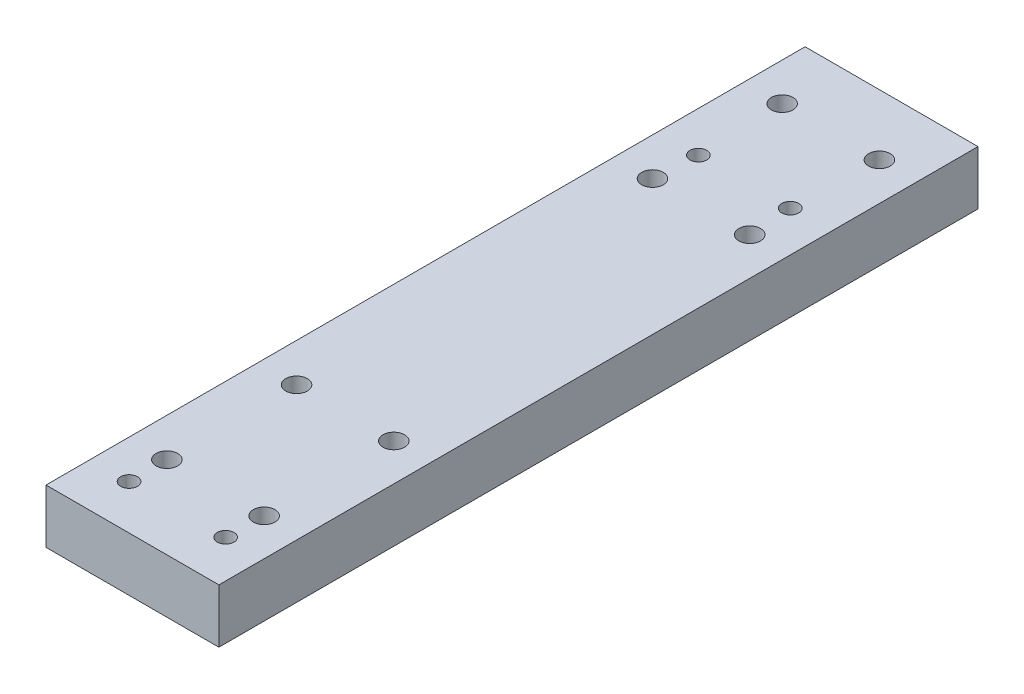
ISO-10303-21;
HEADER;
FILE_DESCRIPTION(('STEP AP214'),'2;1');
FILE_NAME('part.step','',(''),(''),'','','');
FILE_SCHEMA(('AUTOMOTIVE_DESIGN { 1 0 10303 214 1 1 1 1 }'));
ENDSEC;
DATA;
#1=APPLICATION_CONTEXT('core data for automotive mechanical design processes');
#2=APPLICATION_PROTOCOL_DEFINITION('international standard','automotive_design',2000,#1);
#3=PRODUCT_CONTEXT('',#1,'mechanical');
#4=PRODUCT('Part','Part','',(#3));
#5=PRODUCT_RELATED_PRODUCT_CATEGORY('part','',(#4));
#6=PRODUCT_DEFINITION_FORMATION('','',#4);
#7=PRODUCT_DEFINITION_CONTEXT('part definition',#1,'design');
#8=PRODUCT_DEFINITION('design','',#6,#7);
#9=PRODUCT_DEFINITION_SHAPE('','',#8);
#10=(LENGTH_UNIT() NAMED_UNIT(*) SI_UNIT(.MILLI.,.METRE.));
#11=(NAMED_UNIT(*) PLANE_ANGLE_UNIT() SI_UNIT($,.RADIAN.));
#12=(NAMED_UNIT(*) SI_UNIT($,.STERADIAN.) SOLID_ANGLE_UNIT());
#13=UNCERTAINTY_MEASURE_WITH_UNIT(LENGTH_MEASURE(1.E-05),#10,'distance_accuracy_value','');
#14=(GEOMETRIC_REPRESENTATION_CONTEXT(3) GLOBAL_UNCERTAINTY_ASSIGNED_CONTEXT((#13)) GLOBAL_UNIT_ASSIGNED_CONTEXT((#10,
#11,#12)) REPRESENTATION_CONTEXT('',''));
#15=CARTESIAN_POINT('',(0.,0.,0.));
#16=DIRECTION('',(0.,0.,1.));
#17=DIRECTION('',(1.,0.,0.));
#18=AXIS2_PLACEMENT_3D('',#15,#16,#17);
#19=CARTESIAN_POINT('',(0.,10.,0.));
#20=DIRECTION('',(0.,1.,0.));
#21=DIRECTION('',(0.,0.,1.));
#22=AXIS2_PLACEMENT_3D('',#19,#20,#21);
#23=PLANE('',#22);
#24=CARTESIAN_POINT('',(9.12227938256409,10.,54.999894702405));
#25=DIRECTION('',(0.,1.,0.));
#26=DIRECTION('',(0.,0.,1.));
#27=AXIS2_PLACEMENT_3D('',#24,#25,#26);
#28=CIRCLE('',#27,2.);
#29=CARTESIAN_POINT('',(9.12227938256409,10.,56.999894702405));
#30=VERTEX_POINT('',#29);
#31=EDGE_CURVE('E169',#30,#30,#28,.T.);
#32=ORIENTED_EDGE('',*,*,#31,.F.);
#33=EDGE_LOOP('',(#32));
#34=FACE_BOUND('',#33,.T.);
#35=CARTESIAN_POINT('',(-8.87772061743592,10.,30.999894702405));
#36=DIRECTION('',(0.,1.,0.));
#37=DIRECTION('',(0.,0.,1.));
#38=AXIS2_PLACEMENT_3D('',#35,#36,#37);
#39=CIRCLE('',#38,2.);
#40=CARTESIAN_POINT('',(-8.87772061743592,10.,32.999894702405));
#41=VERTEX_POINT('',#40);
#42=EDGE_CURVE('E157',#41,#41,#39,.T.);
#43=ORIENTED_EDGE('',*,*,#42,.F.);
#44=EDGE_LOOP('',(#43));
#45=FACE_BOUND('',#44,.T.);
#46=CARTESIAN_POINT('',(-8.87772061743592,10.,61.999894702405));
#47=DIRECTION('',(0.,1.,0.));
#48=DIRECTION('',(0.,0.,1.));
#49=AXIS2_PLACEMENT_3D('',#46,#47,#48);
#50=CIRCLE('',#49,1.55);
#51=CARTESIAN_POINT('',(-8.87772061743592,10.,63.549894702405));
#52=VERTEX_POINT('',#51);
#53=EDGE_CURVE('E145',#52,#52,#50,.T.);
#54=ORIENTED_EDGE('',*,*,#53,.F.);
#55=EDGE_LOOP('',(#54));
#56=FACE_BOUND('',#55,.T.);
#57=CARTESIAN_POINT('',(-8.50000000000001,10.,-43.000105297595));
#58=DIRECTION('',(0.,1.,0.));
#59=DIRECTION('',(0.,0.,1.));
#60=AXIS2_PLACEMENT_3D('',#57,#58,#59);
#61=CIRCLE('',#60,1.55);
#62=CARTESIAN_POINT('',(-8.50000000000001,10.,-41.450105297595));
#63=VERTEX_POINT('',#62);
#64=EDGE_CURVE('E133',#63,#63,#61,.T.);
#65=ORIENTED_EDGE('',*,*,#64,.F.);
#66=EDGE_LOOP('',(#65));
#67=FACE_BOUND('',#66,.T.);
#68=CARTESIAN_POINT('',(-9.00000000000001,10.,-35.));
#69=DIRECTION('',(0.,1.,0.));
#70=DIRECTION('',(0.,0.,1.));
#71=AXIS2_PLACEMENT_3D('',#68,#69,#70);
#72=CIRCLE('',#71,2.);
#73=CARTESIAN_POINT('',(-9.00000000000001,10.,-33.));
#74=VERTEX_POINT('',#73);
#75=EDGE_CURVE('E121',#74,#74,#72,.T.);
#76=ORIENTED_EDGE('',*,*,#75,.F.);
#77=EDGE_LOOP('',(#76));
#78=FACE_BOUND('',#77,.T.);
#79=CARTESIAN_POINT('',(-9.00000000000001,10.,-59.));
#80=DIRECTION('',(0.,1.,0.));
#81=DIRECTION('',(0.,0.,1.));
#82=AXIS2_PLACEMENT_3D('',#79,#80,#81);
#83=CIRCLE('',#82,2.);
#84=CARTESIAN_POINT('',(-9.00000000000001,10.,-57.));
#85=VERTEX_POINT('',#84);
#86=EDGE_CURVE('E100',#85,#85,#83,.T.);
#87=ORIENTED_EDGE('',*,*,#86,.F.);
#88=EDGE_LOOP('',(#87));
#89=FACE_BOUND('',#88,.T.);
#90=DIRECTION('',(0.,0.,-1.));
#91=VECTOR('',#90,1.);
#92=CARTESIAN_POINT('',(16.,10.,-70.25));
#93=LINE('',#92,#91);
#94=CARTESIAN_POINT('',(16.,10.,70.25));
#95=VERTEX_POINT('',#94);
#96=CARTESIAN_POINT('',(16.,10.,-70.25));
#97=VERTEX_POINT('',#96);
#98=EDGE_CURVE('E85',#95,#97,#93,.T.);
#99=ORIENTED_EDGE('',*,*,#98,.T.);
#100=DIRECTION('',(-1.,0.,0.));
#101=VECTOR('',#100,1.);
#102=CARTESIAN_POINT('',(-16.,10.,-70.25));
#103=LINE('',#102,#101);
#104=CARTESIAN_POINT('',(-16.,10.,-70.25));
#105=VERTEX_POINT('',#104);
#106=EDGE_CURVE('E80',#97,#105,#103,.T.);
#107=ORIENTED_EDGE('',*,*,#106,.T.);
#108=DIRECTION('',(0.,0.,1.));
#109=VECTOR('',#108,1.);
#110=CARTESIAN_POINT('',(-16.,10.,-70.25));
#111=LINE('',#110,#109);
#112=CARTESIAN_POINT('',(-16.,10.,70.25));
#113=VERTEX_POINT('',#112);
#114=EDGE_CURVE('E83',#105,#113,#111,.T.);
#115=ORIENTED_EDGE('',*,*,#114,.T.);
#116=DIRECTION('',(1.,0.,0.));
#117=VECTOR('',#116,1.);
#118=CARTESIAN_POINT('',(-16.,10.,70.25));
#119=LINE('',#118,#117);
#120=EDGE_CURVE('E50',#113,#95,#119,.T.);
#121=ORIENTED_EDGE('',*,*,#120,.T.);
#122=EDGE_LOOP('',(#99,#107,#115,#121));
#123=FACE_BOUND('',#122,.T.);
#124=CARTESIAN_POINT('',(8.99999999999999,10.,-59.));
#125=DIRECTION('',(0.,1.,0.));
#126=DIRECTION('',(0.,0.,1.));
#127=AXIS2_PLACEMENT_3D('',#124,#125,#126);
#128=CIRCLE('',#127,2.);
#129=CARTESIAN_POINT('',(8.99999999999999,10.,-57.));
#130=VERTEX_POINT('',#129);
#131=EDGE_CURVE('E115',#130,#130,#128,.T.);
#132=ORIENTED_EDGE('',*,*,#131,.F.);
#133=EDGE_LOOP('',(#132));
#134=FACE_BOUND('',#133,.T.);
#135=CARTESIAN_POINT('',(8.99999999999999,10.,-35.));
#136=DIRECTION('',(0.,1.,0.));
#137=DIRECTION('',(0.,0.,1.));
#138=AXIS2_PLACEMENT_3D('',#135,#136,#137);
#139=CIRCLE('',#138,2.);
#140=CARTESIAN_POINT('',(8.99999999999999,10.,-33.));
#141=VERTEX_POINT('',#140);
#142=EDGE_CURVE('E127',#141,#141,#139,.T.);
#143=ORIENTED_EDGE('',*,*,#142,.F.);
#144=EDGE_LOOP('',(#143));
#145=FACE_BOUND('',#144,.T.);
#146=CARTESIAN_POINT('',(8.49999999999999,10.,-43.000105297595));
#147=DIRECTION('',(0.,1.,0.));
#148=DIRECTION('',(0.,0.,1.));
#149=AXIS2_PLACEMENT_3D('',#146,#147,#148);
#150=CIRCLE('',#149,1.55);
#151=CARTESIAN_POINT('',(8.49999999999999,10.,-41.450105297595));
#152=VERTEX_POINT('',#151);
#153=EDGE_CURVE('E139',#152,#152,#150,.T.);
#154=ORIENTED_EDGE('',*,*,#153,.F.);
#155=EDGE_LOOP('',(#154));
#156=FACE_BOUND('',#155,.T.);
#157=CARTESIAN_POINT('',(8.99999999999999,10.,61.999894702405));
#158=DIRECTION('',(0.,1.,0.));
#159=DIRECTION('',(0.,0.,1.));
#160=AXIS2_PLACEMENT_3D('',#157,#158,#159);
#161=CIRCLE('',#160,1.55);
#162=CARTESIAN_POINT('',(8.99999999999999,10.,63.549894702405));
#163=VERTEX_POINT('',#162);
#164=EDGE_CURVE('E151',#163,#163,#161,.T.);
#165=ORIENTED_EDGE('',*,*,#164,.F.);
#166=EDGE_LOOP('',(#165));
#167=FACE_BOUND('',#166,.T.);
#168=CARTESIAN_POINT('',(9.12227938256408,10.,30.999894702405));
#169=DIRECTION('',(0.,1.,0.));
#170=DIRECTION('',(0.,0.,1.));
#171=AXIS2_PLACEMENT_3D('',#168,#169,#170);
#172=CIRCLE('',#171,2.);
#173=CARTESIAN_POINT('',(9.12227938256408,10.,32.999894702405));
#174=VERTEX_POINT('',#173);
#175=EDGE_CURVE('E163',#174,#174,#172,.T.);
#176=ORIENTED_EDGE('',*,*,#175,.F.);
#177=EDGE_LOOP('',(#176));
#178=FACE_BOUND('',#177,.T.);
#179=CARTESIAN_POINT('',(-8.87772061743591,10.,54.999894702405));
#180=DIRECTION('',(0.,1.,0.));
#181=DIRECTION('',(0.,0.,1.));
#182=AXIS2_PLACEMENT_3D('',#179,#180,#181);
#183=CIRCLE('',#182,2.);
#184=CARTESIAN_POINT('',(-8.87772061743591,10.,56.999894702405));
#185=VERTEX_POINT('',#184);
#186=EDGE_CURVE('E175',#185,#185,#183,.T.);
#187=ORIENTED_EDGE('',*,*,#186,.F.);
#188=EDGE_LOOP('',(#187));
#189=FACE_BOUND('',#188,.T.);
#190=ADVANCED_FACE('F33',(#34,#45,#56,#67,#78,#89,#123,#134,#145,#156,#167,#178,#189),#23,.T.);
#191=CARTESIAN_POINT('',(0.,0.,0.));
#192=DIRECTION('',(0.,1.,0.));
#193=DIRECTION('',(0.,0.,1.));
#194=AXIS2_PLACEMENT_3D('',#191,#192,#193);
#195=PLANE('',#194);
#196=DIRECTION('',(0.,0.,-1.));
#197=VECTOR('',#196,1.);
#198=CARTESIAN_POINT('',(16.,0.,-70.25));
#199=LINE('',#198,#197);
#200=CARTESIAN_POINT('',(16.,0.,70.25));
#201=VERTEX_POINT('',#200);
#202=CARTESIAN_POINT('',(16.,0.,-70.25));
#203=VERTEX_POINT('',#202);
#204=EDGE_CURVE('E97',#201,#203,#199,.T.);
#205=ORIENTED_EDGE('',*,*,#204,.F.);
#206=DIRECTION('',(1.,0.,0.));
#207=VECTOR('',#206,1.);
#208=CARTESIAN_POINT('',(-16.,0.,70.25));
#209=LINE('',#208,#207);
#210=CARTESIAN_POINT('',(-16.,0.,70.25));
#211=VERTEX_POINT('',#210);
#212=EDGE_CURVE('E73',#211,#201,#209,.T.);
#213=ORIENTED_EDGE('',*,*,#212,.F.);
#214=DIRECTION('',(0.,0.,1.));
#215=VECTOR('',#214,1.);
#216=CARTESIAN_POINT('',(-16.,0.,-70.25));
#217=LINE('',#216,#215);
#218=CARTESIAN_POINT('',(-16.,0.,-70.25));
#219=VERTEX_POINT('',#218);
#220=EDGE_CURVE('E67',#219,#211,#217,.T.);
#221=ORIENTED_EDGE('',*,*,#220,.F.);
#222=DIRECTION('',(-1.,0.,0.));
#223=VECTOR('',#222,1.);
#224=CARTESIAN_POINT('',(-16.,0.,-70.25));
#225=LINE('',#224,#223);
#226=EDGE_CURVE('E89',#203,#219,#225,.T.);
#227=ORIENTED_EDGE('',*,*,#226,.F.);
#228=EDGE_LOOP('',(#205,#213,#221,#227));
#229=FACE_BOUND('',#228,.T.);
#230=CARTESIAN_POINT('',(-9.00000000000001,0.,-59.));
#231=DIRECTION('',(0.,1.,0.));
#232=DIRECTION('',(0.,0.,1.));
#233=AXIS2_PLACEMENT_3D('',#230,#231,#232);
#234=CIRCLE('',#233,2.);
#235=CARTESIAN_POINT('',(-9.00000000000001,0.,-57.));
#236=VERTEX_POINT('',#235);
#237=EDGE_CURVE('E112',#236,#236,#234,.T.);
#238=ORIENTED_EDGE('',*,*,#237,.T.);
#239=EDGE_LOOP('',(#238));
#240=FACE_BOUND('',#239,.T.);
#241=CARTESIAN_POINT('',(8.99999999999999,0.,-59.));
#242=DIRECTION('',(0.,1.,0.));
#243=DIRECTION('',(0.,0.,1.));
#244=AXIS2_PLACEMENT_3D('',#241,#242,#243);
#245=CIRCLE('',#244,2.);
#246=CARTESIAN_POINT('',(8.99999999999999,0.,-57.));
#247=VERTEX_POINT('',#246);
#248=EDGE_CURVE('E118',#247,#247,#245,.T.);
#249=ORIENTED_EDGE('',*,*,#248,.T.);
#250=EDGE_LOOP('',(#249));
#251=FACE_BOUND('',#250,.T.);
#252=CARTESIAN_POINT('',(-9.00000000000001,0.,-35.));
#253=DIRECTION('',(0.,1.,0.));
#254=DIRECTION('',(0.,0.,1.));
#255=AXIS2_PLACEMENT_3D('',#252,#253,#254);
#256=CIRCLE('',#255,2.);
#257=CARTESIAN_POINT('',(-9.00000000000001,0.,-33.));
#258=VERTEX_POINT('',#257);
#259=EDGE_CURVE('E124',#258,#258,#256,.T.);
#260=ORIENTED_EDGE('',*,*,#259,.T.);
#261=EDGE_LOOP('',(#260));
#262=FACE_BOUND('',#261,.T.);
#263=CARTESIAN_POINT('',(8.99999999999999,0.,-35.));
#264=DIRECTION('',(0.,1.,0.));
#265=DIRECTION('',(0.,0.,1.));
#266=AXIS2_PLACEMENT_3D('',#263,#264,#265);
#267=CIRCLE('',#266,2.);
#268=CARTESIAN_POINT('',(8.99999999999999,0.,-33.));
#269=VERTEX_POINT('',#268);
#270=EDGE_CURVE('E130',#269,#269,#267,.T.);
#271=ORIENTED_EDGE('',*,*,#270,.T.);
#272=EDGE_LOOP('',(#271));
#273=FACE_BOUND('',#272,.T.);
#274=CARTESIAN_POINT('',(-8.50000000000001,0.,-43.000105297595));
#275=DIRECTION('',(0.,1.,0.));
#276=DIRECTION('',(0.,0.,1.));
#277=AXIS2_PLACEMENT_3D('',#274,#275,#276);
#278=CIRCLE('',#277,1.55);
#279=CARTESIAN_POINT('',(-8.50000000000001,0.,-41.450105297595));
#280=VERTEX_POINT('',#279);
#281=EDGE_CURVE('E136',#280,#280,#278,.T.);
#282=ORIENTED_EDGE('',*,*,#281,.T.);
#283=EDGE_LOOP('',(#282));
#284=FACE_BOUND('',#283,.T.);
#285=CARTESIAN_POINT('',(8.49999999999999,0.,-43.000105297595));
#286=DIRECTION('',(0.,1.,0.));
#287=DIRECTION('',(0.,0.,1.));
#288=AXIS2_PLACEMENT_3D('',#285,#286,#287);
#289=CIRCLE('',#288,1.55);
#290=CARTESIAN_POINT('',(8.49999999999999,0.,-41.450105297595));
#291=VERTEX_POINT('',#290);
#292=EDGE_CURVE('E142',#291,#291,#289,.T.);
#293=ORIENTED_EDGE('',*,*,#292,.T.);
#294=EDGE_LOOP('',(#293));
#295=FACE_BOUND('',#294,.T.);
#296=CARTESIAN_POINT('',(-8.87772061743592,0.,61.999894702405));
#297=DIRECTION('',(0.,1.,0.));
#298=DIRECTION('',(0.,0.,1.));
#299=AXIS2_PLACEMENT_3D('',#296,#297,#298);
#300=CIRCLE('',#299,1.55);
#301=CARTESIAN_POINT('',(-8.87772061743592,0.,63.549894702405));
#302=VERTEX_POINT('',#301);
#303=EDGE_CURVE('E148',#302,#302,#300,.T.);
#304=ORIENTED_EDGE('',*,*,#303,.T.);
#305=EDGE_LOOP('',(#304));
#306=FACE_BOUND('',#305,.T.);
#307=CARTESIAN_POINT('',(8.99999999999999,0.,61.999894702405));
#308=DIRECTION('',(0.,1.,0.));
#309=DIRECTION('',(0.,0.,1.));
#310=AXIS2_PLACEMENT_3D('',#307,#308,#309);
#311=CIRCLE('',#310,1.55);
#312=CARTESIAN_POINT('',(8.99999999999999,0.,63.549894702405));
#313=VERTEX_POINT('',#312);
#314=EDGE_CURVE('E154',#313,#313,#311,.T.);
#315=ORIENTED_EDGE('',*,*,#314,.T.);
#316=EDGE_LOOP('',(#315));
#317=FACE_BOUND('',#316,.T.);
#318=CARTESIAN_POINT('',(-8.87772061743592,0.,30.999894702405));
#319=DIRECTION('',(0.,1.,0.));
#320=DIRECTION('',(0.,0.,1.));
#321=AXIS2_PLACEMENT_3D('',#318,#319,#320);
#322=CIRCLE('',#321,2.);
#323=CARTESIAN_POINT('',(-8.87772061743592,0.,32.999894702405));
#324=VERTEX_POINT('',#323);
#325=EDGE_CURVE('E160',#324,#324,#322,.T.);
#326=ORIENTED_EDGE('',*,*,#325,.T.);
#327=EDGE_LOOP('',(#326));
#328=FACE_BOUND('',#327,.T.);
#329=CARTESIAN_POINT('',(9.12227938256408,0.,30.999894702405));
#330=DIRECTION('',(0.,1.,0.));
#331=DIRECTION('',(0.,0.,1.));
#332=AXIS2_PLACEMENT_3D('',#329,#330,#331);
#333=CIRCLE('',#332,2.);
#334=CARTESIAN_POINT('',(9.12227938256408,0.,32.999894702405));
#335=VERTEX_POINT('',#334);
#336=EDGE_CURVE('E166',#335,#335,#333,.T.);
#337=ORIENTED_EDGE('',*,*,#336,.T.);
#338=EDGE_LOOP('',(#337));
#339=FACE_BOUND('',#338,.T.);
#340=CARTESIAN_POINT('',(9.12227938256409,0.,54.999894702405));
#341=DIRECTION('',(0.,1.,0.));
#342=DIRECTION('',(0.,0.,1.));
#343=AXIS2_PLACEMENT_3D('',#340,#341,#342);
#344=CIRCLE('',#343,2.);
#345=CARTESIAN_POINT('',(9.12227938256409,0.,56.999894702405));
#346=VERTEX_POINT('',#345);
#347=EDGE_CURVE('E172',#346,#346,#344,.T.);
#348=ORIENTED_EDGE('',*,*,#347,.T.);
#349=EDGE_LOOP('',(#348));
#350=FACE_BOUND('',#349,.T.);
#351=CARTESIAN_POINT('',(-8.87772061743591,0.,54.999894702405));
#352=DIRECTION('',(0.,1.,0.));
#353=DIRECTION('',(0.,0.,1.));
#354=AXIS2_PLACEMENT_3D('',#351,#352,#353);
#355=CIRCLE('',#354,2.);
#356=CARTESIAN_POINT('',(-8.87772061743591,0.,56.999894702405));
#357=VERTEX_POINT('',#356);
#358=EDGE_CURVE('E178',#357,#357,#355,.T.);
#359=ORIENTED_EDGE('',*,*,#358,.T.);
#360=EDGE_LOOP('',(#359));
#361=FACE_BOUND('',#360,.T.);
#362=ADVANCED_FACE('F108',(#229,#240,#251,#262,#273,#284,#295,#306,#317,#328,#339,#350,#361),
#195,.F.);
#363=CARTESIAN_POINT('',(16.,10.,-70.25));
#364=DIRECTION('',(-1.,0.,0.));
#365=DIRECTION('',(0.,0.,1.));
#366=AXIS2_PLACEMENT_3D('',#363,#364,#365);
#367=PLANE('',#366);
#368=ORIENTED_EDGE('',*,*,#204,.T.);
#369=DIRECTION('',(0.,-1.,0.));
#370=VECTOR('',#369,1.);
#371=CARTESIAN_POINT('',(16.,10.,-70.25));
#372=LINE('',#371,#370);
#373=EDGE_CURVE('E11',#97,#203,#372,.T.);
#374=ORIENTED_EDGE('',*,*,#373,.F.);
#375=ORIENTED_EDGE('',*,*,#98,.F.);
#376=DIRECTION('',(0.,-1.,0.));
#377=VECTOR('',#376,1.);
#378=CARTESIAN_POINT('',(16.,10.,70.25));
#379=LINE('',#378,#377);
#380=EDGE_CURVE('E93',#95,#201,#379,.T.);
#381=ORIENTED_EDGE('',*,*,#380,.T.);
#382=EDGE_LOOP('',(#368,#374,#375,#381));
#383=FACE_BOUND('',#382,.T.);
#384=ADVANCED_FACE('F35',(#383),#367,.F.);
#385=CARTESIAN_POINT('',(-16.,10.,-70.25));
#386=DIRECTION('',(0.,0.,1.));
#387=DIRECTION('',(1.,0.,0.));
#388=AXIS2_PLACEMENT_3D('',#385,#386,#387);
#389=PLANE('',#388);
#390=ORIENTED_EDGE('',*,*,#226,.T.);
#391=DIRECTION('',(0.,-1.,0.));
#392=VECTOR('',#391,1.);
#393=CARTESIAN_POINT('',(-16.,10.,-70.25));
#394=LINE('',#393,#392);
#395=EDGE_CURVE('E42',#105,#219,#394,.T.);
#396=ORIENTED_EDGE('',*,*,#395,.F.);
#397=ORIENTED_EDGE('',*,*,#106,.F.);
#398=ORIENTED_EDGE('',*,*,#373,.T.);
#399=EDGE_LOOP('',(#390,#396,#397,#398));
#400=FACE_BOUND('',#399,.T.);
#401=ADVANCED_FACE('F88',(#400),#389,.F.);
#402=CARTESIAN_POINT('',(-16.,10.,-70.25));
#403=DIRECTION('',(1.,0.,0.));
#404=DIRECTION('',(0.,0.,-1.));
#405=AXIS2_PLACEMENT_3D('',#402,#403,#404);
#406=PLANE('',#405);
#407=ORIENTED_EDGE('',*,*,#220,.T.);
#408=DIRECTION('',(0.,-1.,0.));
#409=VECTOR('',#408,1.);
#410=CARTESIAN_POINT('',(-16.,10.,70.25));
#411=LINE('',#410,#409);
#412=EDGE_CURVE('E90',#113,#211,#411,.T.);
#413=ORIENTED_EDGE('',*,*,#412,.F.);
#414=ORIENTED_EDGE('',*,*,#114,.F.);
#415=ORIENTED_EDGE('',*,*,#395,.T.);
#416=EDGE_LOOP('',(#407,#413,#414,#415));
#417=FACE_BOUND('',#416,.T.);
#418=ADVANCED_FACE('F91',(#417),#406,.F.);
#419=CARTESIAN_POINT('',(-16.,10.,70.25));
#420=DIRECTION('',(0.,0.,-1.));
#421=DIRECTION('',(-1.,0.,0.));
#422=AXIS2_PLACEMENT_3D('',#419,#420,#421);
#423=PLANE('',#422);
#424=ORIENTED_EDGE('',*,*,#212,.T.);
#425=ORIENTED_EDGE('',*,*,#380,.F.);
#426=ORIENTED_EDGE('',*,*,#120,.F.);
#427=ORIENTED_EDGE('',*,*,#412,.T.);
#428=EDGE_LOOP('',(#424,#425,#426,#427));
#429=FACE_BOUND('',#428,.T.);
#430=ADVANCED_FACE('F105',(#429),#423,.F.);
#431=CARTESIAN_POINT('',(-9.00000000000001,10.,-59.));
#432=DIRECTION('',(0.,-1.,0.));
#433=DIRECTION('',(0.,0.,-1.));
#434=AXIS2_PLACEMENT_3D('',#431,#432,#433);
#435=CYLINDRICAL_SURFACE('',#434,2.);
#436=ORIENTED_EDGE('',*,*,#86,.T.);
#437=EDGE_LOOP('',(#436));
#438=FACE_BOUND('',#437,.T.);
#439=ORIENTED_EDGE('',*,*,#237,.F.);
#440=EDGE_LOOP('',(#439));
#441=FACE_BOUND('',#440,.T.);
#442=ADVANCED_FACE('F197',(#438,#441),#435,.F.);
#443=CARTESIAN_POINT('',(8.99999999999999,10.,-59.));
#444=DIRECTION('',(0.,-1.,0.));
#445=DIRECTION('',(0.,0.,-1.));
#446=AXIS2_PLACEMENT_3D('',#443,#444,#445);
#447=CYLINDRICAL_SURFACE('',#446,2.);
#448=ORIENTED_EDGE('',*,*,#131,.T.);
#449=EDGE_LOOP('',(#448));
#450=FACE_BOUND('',#449,.T.);
#451=ORIENTED_EDGE('',*,*,#248,.F.);
#452=EDGE_LOOP('',(#451));
#453=FACE_BOUND('',#452,.T.);
#454=ADVANCED_FACE('F243',(#450,#453),#447,.F.);
#455=CARTESIAN_POINT('',(-9.00000000000001,10.,-35.));
#456=DIRECTION('',(0.,-1.,0.));
#457=DIRECTION('',(0.,0.,-1.));
#458=AXIS2_PLACEMENT_3D('',#455,#456,#457);
#459=CYLINDRICAL_SURFACE('',#458,2.);
#460=ORIENTED_EDGE('',*,*,#75,.T.);
#461=EDGE_LOOP('',(#460));
#462=FACE_BOUND('',#461,.T.);
#463=ORIENTED_EDGE('',*,*,#259,.F.);
#464=EDGE_LOOP('',(#463));
#465=FACE_BOUND('',#464,.T.);
#466=ADVANCED_FACE('F251',(#462,#465),#459,.F.);
#467=CARTESIAN_POINT('',(8.99999999999999,10.,-35.));
#468=DIRECTION('',(0.,-1.,0.));
#469=DIRECTION('',(0.,0.,-1.));
#470=AXIS2_PLACEMENT_3D('',#467,#468,#469);
#471=CYLINDRICAL_SURFACE('',#470,2.);
#472=ORIENTED_EDGE('',*,*,#142,.T.);
#473=EDGE_LOOP('',(#472));
#474=FACE_BOUND('',#473,.T.);
#475=ORIENTED_EDGE('',*,*,#270,.F.);
#476=EDGE_LOOP('',(#475));
#477=FACE_BOUND('',#476,.T.);
#478=ADVANCED_FACE('F259',(#474,#477),#471,.F.);
#479=CARTESIAN_POINT('',(-8.50000000000001,10.,-43.000105297595));
#480=DIRECTION('',(0.,-1.,0.));
#481=DIRECTION('',(0.,0.,-1.));
#482=AXIS2_PLACEMENT_3D('',#479,#480,#481);
#483=CYLINDRICAL_SURFACE('',#482,1.55);
#484=ORIENTED_EDGE('',*,*,#64,.T.);
#485=EDGE_LOOP('',(#484));
#486=FACE_BOUND('',#485,.T.);
#487=ORIENTED_EDGE('',*,*,#281,.F.);
#488=EDGE_LOOP('',(#487));
#489=FACE_BOUND('',#488,.T.);
#490=ADVANCED_FACE('F268',(#486,#489),#483,.F.);
#491=CARTESIAN_POINT('',(8.49999999999999,10.,-43.000105297595));
#492=DIRECTION('',(0.,-1.,0.));
#493=DIRECTION('',(0.,0.,-1.));
#494=AXIS2_PLACEMENT_3D('',#491,#492,#493);
#495=CYLINDRICAL_SURFACE('',#494,1.55);
#496=ORIENTED_EDGE('',*,*,#153,.T.);
#497=EDGE_LOOP('',(#496));
#498=FACE_BOUND('',#497,.T.);
#499=ORIENTED_EDGE('',*,*,#292,.F.);
#500=EDGE_LOOP('',(#499));
#501=FACE_BOUND('',#500,.T.);
#502=ADVANCED_FACE('F277',(#498,#501),#495,.F.);
#503=CARTESIAN_POINT('',(-8.87772061743592,10.,61.999894702405));
#504=DIRECTION('',(0.,-1.,0.));
#505=DIRECTION('',(0.,0.,-1.));
#506=AXIS2_PLACEMENT_3D('',#503,#504,#505);
#507=CYLINDRICAL_SURFACE('',#506,1.55);
#508=ORIENTED_EDGE('',*,*,#53,.T.);
#509=EDGE_LOOP('',(#508));
#510=FACE_BOUND('',#509,.T.);
#511=ORIENTED_EDGE('',*,*,#303,.F.);
#512=EDGE_LOOP('',(#511));
#513=FACE_BOUND('',#512,.T.);
#514=ADVANCED_FACE('F286',(#510,#513),#507,.F.);
#515=CARTESIAN_POINT('',(8.99999999999999,10.,61.999894702405));
#516=DIRECTION('',(0.,-1.,0.));
#517=DIRECTION('',(0.,0.,-1.));
#518=AXIS2_PLACEMENT_3D('',#515,#516,#517);
#519=CYLINDRICAL_SURFACE('',#518,1.55);
#520=ORIENTED_EDGE('',*,*,#164,.T.);
#521=EDGE_LOOP('',(#520));
#522=FACE_BOUND('',#521,.T.);
#523=ORIENTED_EDGE('',*,*,#314,.F.);
#524=EDGE_LOOP('',(#523));
#525=FACE_BOUND('',#524,.T.);
#526=ADVANCED_FACE('F295',(#522,#525),#519,.F.);
#527=CARTESIAN_POINT('',(-8.87772061743592,10.,30.999894702405));
#528=DIRECTION('',(0.,-1.,0.));
#529=DIRECTION('',(0.,0.,-1.));
#530=AXIS2_PLACEMENT_3D('',#527,#528,#529);
#531=CYLINDRICAL_SURFACE('',#530,2.);
#532=ORIENTED_EDGE('',*,*,#42,.T.);
#533=EDGE_LOOP('',(#532));
#534=FACE_BOUND('',#533,.T.);
#535=ORIENTED_EDGE('',*,*,#325,.F.);
#536=EDGE_LOOP('',(#535));
#537=FACE_BOUND('',#536,.T.);
#538=ADVANCED_FACE('F304',(#534,#537),#531,.F.);
#539=CARTESIAN_POINT('',(9.12227938256408,10.,30.999894702405));
#540=DIRECTION('',(0.,-1.,0.));
#541=DIRECTION('',(0.,0.,-1.));
#542=AXIS2_PLACEMENT_3D('',#539,#540,#541);
#543=CYLINDRICAL_SURFACE('',#542,2.);
#544=ORIENTED_EDGE('',*,*,#175,.T.);
#545=EDGE_LOOP('',(#544));
#546=FACE_BOUND('',#545,.T.);
#547=ORIENTED_EDGE('',*,*,#336,.F.);
#548=EDGE_LOOP('',(#547));
#549=FACE_BOUND('',#548,.T.);
#550=ADVANCED_FACE('F313',(#546,#549),#543,.F.);
#551=CARTESIAN_POINT('',(9.12227938256409,10.,54.999894702405));
#552=DIRECTION('',(0.,-1.,0.));
#553=DIRECTION('',(0.,0.,-1.));
#554=AXIS2_PLACEMENT_3D('',#551,#552,#553);
#555=CYLINDRICAL_SURFACE('',#554,2.);
#556=ORIENTED_EDGE('',*,*,#31,.T.);
#557=EDGE_LOOP('',(#556));
#558=FACE_BOUND('',#557,.T.);
#559=ORIENTED_EDGE('',*,*,#347,.F.);
#560=EDGE_LOOP('',(#559));
#561=FACE_BOUND('',#560,.T.);
#562=ADVANCED_FACE('F322',(#558,#561),#555,.F.);
#563=CARTESIAN_POINT('',(-8.87772061743591,10.,54.999894702405));
#564=DIRECTION('',(0.,-1.,0.));
#565=DIRECTION('',(0.,0.,-1.));
#566=AXIS2_PLACEMENT_3D('',#563,#564,#565);
#567=CYLINDRICAL_SURFACE('',#566,2.);
#568=ORIENTED_EDGE('',*,*,#186,.T.);
#569=EDGE_LOOP('',(#568));
#570=FACE_BOUND('',#569,.T.);
#571=ORIENTED_EDGE('',*,*,#358,.F.);
#572=EDGE_LOOP('',(#571));
#573=FACE_BOUND('',#572,.T.);
#574=ADVANCED_FACE('F184',(#570,#573),#567,.F.);
#575=CLOSED_SHELL('',(#190,#362,#384,#401,#418,#430,#442,#454,#466,#478,#490,#502,#514,#526,
#538,#550,#562,#574));
#576=MANIFOLD_SOLID_BREP('B2',#575);
#577=ADVANCED_BREP_SHAPE_REPRESENTATION('',(#18,#576),#14);
#578=SHAPE_DEFINITION_REPRESENTATION(#9,#577);
ENDSEC;
END-ISO-10303-21;
